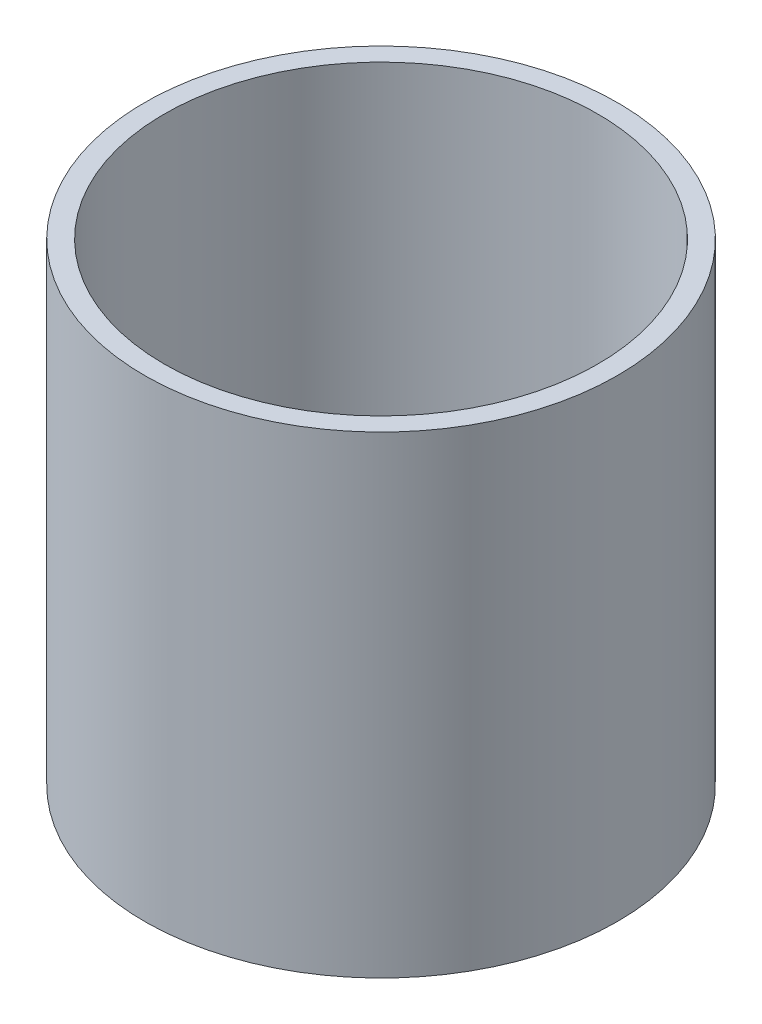
ISO-10303-21;
HEADER;
FILE_DESCRIPTION(('STEP AP214'),'2;1');
FILE_NAME('part.step','',(''),(''),'','','');
FILE_SCHEMA(('AUTOMOTIVE_DESIGN { 1 0 10303 214 1 1 1 1 }'));
ENDSEC;
DATA;
#1=APPLICATION_CONTEXT('core data for automotive mechanical design processes');
#2=APPLICATION_PROTOCOL_DEFINITION('international standard','automotive_design',2000,#1);
#3=PRODUCT_CONTEXT('',#1,'mechanical');
#4=PRODUCT('Part','Part','',(#3));
#5=PRODUCT_RELATED_PRODUCT_CATEGORY('part','',(#4));
#6=PRODUCT_DEFINITION_FORMATION('','',#4);
#7=PRODUCT_DEFINITION_CONTEXT('part definition',#1,'design');
#8=PRODUCT_DEFINITION('design','',#6,#7);
#9=PRODUCT_DEFINITION_SHAPE('','',#8);
#10=(LENGTH_UNIT() NAMED_UNIT(*) SI_UNIT(.MILLI.,.METRE.));
#11=(NAMED_UNIT(*) PLANE_ANGLE_UNIT() SI_UNIT($,.RADIAN.));
#12=(NAMED_UNIT(*) SI_UNIT($,.STERADIAN.) SOLID_ANGLE_UNIT());
#13=UNCERTAINTY_MEASURE_WITH_UNIT(LENGTH_MEASURE(1.E-05),#10,'distance_accuracy_value','');
#14=(GEOMETRIC_REPRESENTATION_CONTEXT(3) GLOBAL_UNCERTAINTY_ASSIGNED_CONTEXT((#13)) GLOBAL_UNIT_ASSIGNED_CONTEXT((#10,
#11,#12)) REPRESENTATION_CONTEXT('',''));
#15=CARTESIAN_POINT('',(0.,0.,0.));
#16=DIRECTION('',(0.,0.,1.));
#17=DIRECTION('',(1.,0.,0.));
#18=AXIS2_PLACEMENT_3D('',#15,#16,#17);
#19=CARTESIAN_POINT('',(0.,120.,0.));
#20=DIRECTION('',(0.,1.,0.));
#21=DIRECTION('',(0.,0.,1.));
#22=AXIS2_PLACEMENT_3D('',#19,#20,#21);
#23=PLANE('',#22);
#24=CARTESIAN_POINT('',(0.,120.,0.));
#25=DIRECTION('',(0.,1.,0.));
#26=DIRECTION('',(1.,0.,0.));
#27=AXIS2_PLACEMENT_3D('',#24,#25,#26);
#28=CIRCLE('',#27,60.);
#29=CARTESIAN_POINT('',(60.,120.,0.));
#30=VERTEX_POINT('',#29);
#31=EDGE_CURVE('E11',#30,#30,#28,.T.);
#32=ORIENTED_EDGE('',*,*,#31,.T.);
#33=EDGE_LOOP('',(#32));
#34=FACE_BOUND('',#33,.T.);
#35=CARTESIAN_POINT('',(0.,120.,0.));
#36=DIRECTION('',(0.,1.,0.));
#37=DIRECTION('',(0.,0.,1.));
#38=AXIS2_PLACEMENT_3D('',#35,#36,#37);
#39=CIRCLE('',#38,55.);
#40=CARTESIAN_POINT('',(0.,120.,55.));
#41=VERTEX_POINT('',#40);
#42=EDGE_CURVE('E51',#41,#41,#39,.T.);
#43=ORIENTED_EDGE('',*,*,#42,.F.);
#44=EDGE_LOOP('',(#43));
#45=FACE_BOUND('',#44,.T.);
#46=ADVANCED_FACE('F40',(#34,#45),#23,.T.);
#47=CARTESIAN_POINT('',(0.,0.,0.));
#48=DIRECTION('',(0.,1.,0.));
#49=DIRECTION('',(0.,0.,1.));
#50=AXIS2_PLACEMENT_3D('',#47,#48,#49);
#51=PLANE('',#50);
#52=CARTESIAN_POINT('',(0.,0.,0.));
#53=DIRECTION('',(0.,1.,0.));
#54=DIRECTION('',(1.,0.,0.));
#55=AXIS2_PLACEMENT_3D('',#52,#53,#54);
#56=CIRCLE('',#55,60.);
#57=CARTESIAN_POINT('',(60.,0.,0.));
#58=VERTEX_POINT('',#57);
#59=EDGE_CURVE('E44',#58,#58,#56,.T.);
#60=ORIENTED_EDGE('',*,*,#59,.F.);
#61=EDGE_LOOP('',(#60));
#62=FACE_BOUND('',#61,.T.);
#63=CARTESIAN_POINT('',(0.,0.,0.));
#64=DIRECTION('',(0.,1.,0.));
#65=DIRECTION('',(0.,0.,1.));
#66=AXIS2_PLACEMENT_3D('',#63,#64,#65);
#67=CIRCLE('',#66,55.);
#68=CARTESIAN_POINT('',(0.,0.,55.));
#69=VERTEX_POINT('',#68);
#70=EDGE_CURVE('E53',#69,#69,#67,.T.);
#71=ORIENTED_EDGE('',*,*,#70,.T.);
#72=EDGE_LOOP('',(#71));
#73=FACE_BOUND('',#72,.T.);
#74=ADVANCED_FACE('F63',(#62,#73),#51,.F.);
#75=CARTESIAN_POINT('',(0.,120.,0.));
#76=DIRECTION('',(0.,-1.,0.));
#77=DIRECTION('',(0.,0.,-1.));
#78=AXIS2_PLACEMENT_3D('',#75,#76,#77);
#79=CYLINDRICAL_SURFACE('',#78,60.);
#80=ORIENTED_EDGE('',*,*,#31,.F.);
#81=EDGE_LOOP('',(#80));
#82=FACE_BOUND('',#81,.T.);
#83=ORIENTED_EDGE('',*,*,#59,.T.);
#84=EDGE_LOOP('',(#83));
#85=FACE_BOUND('',#84,.T.);
#86=ADVANCED_FACE('F42',(#82,#85),#79,.T.);
#87=CARTESIAN_POINT('',(0.,120.,0.));
#88=DIRECTION('',(0.,-1.,0.));
#89=DIRECTION('',(0.,0.,-1.));
#90=AXIS2_PLACEMENT_3D('',#87,#88,#89);
#91=CYLINDRICAL_SURFACE('',#90,55.);
#92=ORIENTED_EDGE('',*,*,#42,.T.);
#93=EDGE_LOOP('',(#92));
#94=FACE_BOUND('',#93,.T.);
#95=ORIENTED_EDGE('',*,*,#70,.F.);
#96=EDGE_LOOP('',(#95));
#97=FACE_BOUND('',#96,.T.);
#98=ADVANCED_FACE('F59',(#94,#97),#91,.F.);
#99=CLOSED_SHELL('',(#46,#74,#86,#98));
#100=MANIFOLD_SOLID_BREP('B2',#99);
#101=ADVANCED_BREP_SHAPE_REPRESENTATION('',(#18,#100),#14);
#102=SHAPE_DEFINITION_REPRESENTATION(#9,#101);
ENDSEC;
END-ISO-10303-21;
